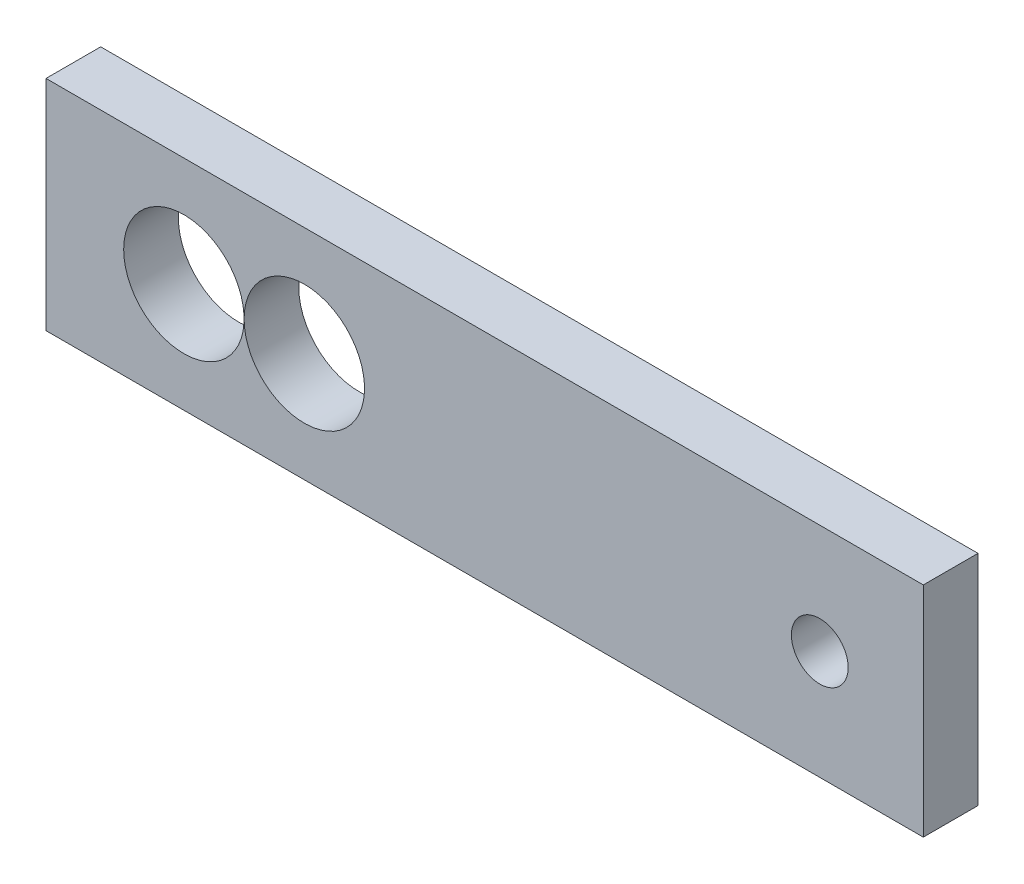
ISO-10303-21;
HEADER;
FILE_DESCRIPTION(('STEP AP214'),'2;1');
FILE_NAME('part.step','',(''),(''),'','','');
FILE_SCHEMA(('AUTOMOTIVE_DESIGN { 1 0 10303 214 1 1 1 1 }'));
ENDSEC;
DATA;
#1=APPLICATION_CONTEXT('core data for automotive mechanical design processes');
#2=APPLICATION_PROTOCOL_DEFINITION('international standard','automotive_design',2000,#1);
#3=PRODUCT_CONTEXT('',#1,'mechanical');
#4=PRODUCT('Part','Part','',(#3));
#5=PRODUCT_RELATED_PRODUCT_CATEGORY('part','',(#4));
#6=PRODUCT_DEFINITION_FORMATION('','',#4);
#7=PRODUCT_DEFINITION_CONTEXT('part definition',#1,'design');
#8=PRODUCT_DEFINITION('design','',#6,#7);
#9=PRODUCT_DEFINITION_SHAPE('','',#8);
#10=(LENGTH_UNIT() NAMED_UNIT(*) SI_UNIT(.MILLI.,.METRE.));
#11=(NAMED_UNIT(*) PLANE_ANGLE_UNIT() SI_UNIT($,.RADIAN.));
#12=(NAMED_UNIT(*) SI_UNIT($,.STERADIAN.) SOLID_ANGLE_UNIT());
#13=UNCERTAINTY_MEASURE_WITH_UNIT(LENGTH_MEASURE(1.E-05),#10,'distance_accuracy_value','');
#14=(GEOMETRIC_REPRESENTATION_CONTEXT(3) GLOBAL_UNCERTAINTY_ASSIGNED_CONTEXT((#13)) GLOBAL_UNIT_ASSIGNED_CONTEXT((#10,
#11,#12)) REPRESENTATION_CONTEXT('',''));
#15=CARTESIAN_POINT('',(0.,0.,0.));
#16=DIRECTION('',(0.,0.,1.));
#17=DIRECTION('',(1.,0.,0.));
#18=AXIS2_PLACEMENT_3D('',#15,#16,#17);
#19=CARTESIAN_POINT('',(-25.5,6.35,-3.18));
#20=DIRECTION('',(-1.,0.,0.));
#21=DIRECTION('',(0.,0.,1.));
#22=AXIS2_PLACEMENT_3D('',#19,#20,#21);
#23=PLANE('',#22);
#24=DIRECTION('',(0.,-1.,0.));
#25=VECTOR('',#24,1.);
#26=CARTESIAN_POINT('',(-25.5,6.35,0.));
#27=LINE('',#26,#25);
#28=CARTESIAN_POINT('',(-25.5,6.35,0.));
#29=VERTEX_POINT('',#28);
#30=CARTESIAN_POINT('',(-25.5,-6.35,0.));
#31=VERTEX_POINT('',#30);
#32=EDGE_CURVE('E108',#29,#31,#27,.T.);
#33=ORIENTED_EDGE('',*,*,#32,.F.);
#34=DIRECTION('',(0.,0.,1.));
#35=VECTOR('',#34,1.);
#36=CARTESIAN_POINT('',(-25.5,6.35,-3.18));
#37=LINE('',#36,#35);
#38=CARTESIAN_POINT('',(-25.5,6.35,-3.18));
#39=VERTEX_POINT('',#38);
#40=EDGE_CURVE('E11',#39,#29,#37,.T.);
#41=ORIENTED_EDGE('',*,*,#40,.F.);
#42=DIRECTION('',(0.,-1.,0.));
#43=VECTOR('',#42,1.);
#44=CARTESIAN_POINT('',(-25.5,6.35,-3.18));
#45=LINE('',#44,#43);
#46=CARTESIAN_POINT('',(-25.5,-6.35,-3.18));
#47=VERTEX_POINT('',#46);
#48=EDGE_CURVE('E101',#39,#47,#45,.T.);
#49=ORIENTED_EDGE('',*,*,#48,.T.);
#50=DIRECTION('',(0.,0.,1.));
#51=VECTOR('',#50,1.);
#52=CARTESIAN_POINT('',(-25.5,-6.35,-3.18));
#53=LINE('',#52,#51);
#54=EDGE_CURVE('E84',#47,#31,#53,.T.);
#55=ORIENTED_EDGE('',*,*,#54,.T.);
#56=EDGE_LOOP('',(#33,#41,#49,#55));
#57=FACE_BOUND('',#56,.T.);
#58=ADVANCED_FACE('F41',(#57),#23,.T.);
#59=CARTESIAN_POINT('',(25.5,6.35,-3.18));
#60=DIRECTION('',(0.,1.,0.));
#61=DIRECTION('',(-1.,0.,0.));
#62=AXIS2_PLACEMENT_3D('',#59,#60,#61);
#63=PLANE('',#62);
#64=DIRECTION('',(-1.,0.,0.));
#65=VECTOR('',#64,1.);
#66=CARTESIAN_POINT('',(25.5,6.35,0.));
#67=LINE('',#66,#65);
#68=CARTESIAN_POINT('',(25.5,6.35,0.));
#69=VERTEX_POINT('',#68);
#70=EDGE_CURVE('E103',#69,#29,#67,.T.);
#71=ORIENTED_EDGE('',*,*,#70,.F.);
#72=DIRECTION('',(0.,0.,1.));
#73=VECTOR('',#72,1.);
#74=CARTESIAN_POINT('',(25.5,6.35,-3.18));
#75=LINE('',#74,#73);
#76=CARTESIAN_POINT('',(25.5,6.35,-3.18));
#77=VERTEX_POINT('',#76);
#78=EDGE_CURVE('E50',#77,#69,#75,.T.);
#79=ORIENTED_EDGE('',*,*,#78,.F.);
#80=DIRECTION('',(-1.,0.,0.));
#81=VECTOR('',#80,1.);
#82=CARTESIAN_POINT('',(25.5,6.35,-3.18));
#83=LINE('',#82,#81);
#84=EDGE_CURVE('E98',#77,#39,#83,.T.);
#85=ORIENTED_EDGE('',*,*,#84,.T.);
#86=ORIENTED_EDGE('',*,*,#40,.T.);
#87=EDGE_LOOP('',(#71,#79,#85,#86));
#88=FACE_BOUND('',#87,.T.);
#89=ADVANCED_FACE('F143',(#88),#63,.T.);
#90=CARTESIAN_POINT('',(25.5,6.35,-3.18));
#91=DIRECTION('',(1.,0.,0.));
#92=DIRECTION('',(0.,0.,-1.));
#93=AXIS2_PLACEMENT_3D('',#90,#91,#92);
#94=PLANE('',#93);
#95=DIRECTION('',(0.,1.,0.));
#96=VECTOR('',#95,1.);
#97=CARTESIAN_POINT('',(25.5,6.35,0.));
#98=LINE('',#97,#96);
#99=CARTESIAN_POINT('',(25.5,-6.35,0.));
#100=VERTEX_POINT('',#99);
#101=EDGE_CURVE('E92',#100,#69,#98,.T.);
#102=ORIENTED_EDGE('',*,*,#101,.F.);
#103=DIRECTION('',(0.,0.,1.));
#104=VECTOR('',#103,1.);
#105=CARTESIAN_POINT('',(25.5,-6.35,-3.18));
#106=LINE('',#105,#104);
#107=CARTESIAN_POINT('',(25.5,-6.35,-3.18));
#108=VERTEX_POINT('',#107);
#109=EDGE_CURVE('E87',#108,#100,#106,.T.);
#110=ORIENTED_EDGE('',*,*,#109,.F.);
#111=DIRECTION('',(0.,1.,0.));
#112=VECTOR('',#111,1.);
#113=CARTESIAN_POINT('',(25.5,6.35,-3.18));
#114=LINE('',#113,#112);
#115=EDGE_CURVE('E90',#108,#77,#114,.T.);
#116=ORIENTED_EDGE('',*,*,#115,.T.);
#117=ORIENTED_EDGE('',*,*,#78,.T.);
#118=EDGE_LOOP('',(#102,#110,#116,#117));
#119=FACE_BOUND('',#118,.T.);
#120=ADVANCED_FACE('F89',(#119),#94,.T.);
#121=CARTESIAN_POINT('',(25.5,-6.35,-3.18));
#122=DIRECTION('',(0.,-1.,0.));
#123=DIRECTION('',(1.,0.,0.));
#124=AXIS2_PLACEMENT_3D('',#121,#122,#123);
#125=PLANE('',#124);
#126=DIRECTION('',(1.,0.,0.));
#127=VECTOR('',#126,1.);
#128=CARTESIAN_POINT('',(25.5,-6.35,0.));
#129=LINE('',#128,#127);
#130=EDGE_CURVE('E111',#31,#100,#129,.T.);
#131=ORIENTED_EDGE('',*,*,#130,.F.);
#132=ORIENTED_EDGE('',*,*,#54,.F.);
#133=DIRECTION('',(1.,0.,0.));
#134=VECTOR('',#133,1.);
#135=CARTESIAN_POINT('',(25.5,-6.35,-3.18));
#136=LINE('',#135,#134);
#137=EDGE_CURVE('E97',#47,#108,#136,.T.);
#138=ORIENTED_EDGE('',*,*,#137,.T.);
#139=ORIENTED_EDGE('',*,*,#109,.T.);
#140=EDGE_LOOP('',(#131,#132,#138,#139));
#141=FACE_BOUND('',#140,.T.);
#142=ADVANCED_FACE('F100',(#141),#125,.T.);
#143=CARTESIAN_POINT('',(0.,0.,-3.18));
#144=DIRECTION('',(0.,0.,-1.));
#145=DIRECTION('',(-1.,0.,0.));
#146=AXIS2_PLACEMENT_3D('',#143,#144,#145);
#147=PLANE('',#146);
#148=CARTESIAN_POINT('',(-17.4849999999995,1.06926114114465E-13,-3.18));
#149=DIRECTION('',(0.,0.,-1.));
#150=DIRECTION('',(-1.,0.,0.));
#151=AXIS2_PLACEMENT_3D('',#148,#149,#150);
#152=CIRCLE('',#151,3.5);
#153=CARTESIAN_POINT('',(-20.9849999999995,1.06926114114465E-13,-3.18));
#154=VERTEX_POINT('',#153);
#155=EDGE_CURVE('E121',#154,#154,#152,.T.);
#156=ORIENTED_EDGE('',*,*,#155,.F.);
#157=EDGE_LOOP('',(#156));
#158=FACE_BOUND('',#157,.T.);
#159=CARTESIAN_POINT('',(19.4824999999999,0.,-3.18));
#160=DIRECTION('',(0.,0.,-1.));
#161=DIRECTION('',(-1.,0.,0.));
#162=AXIS2_PLACEMENT_3D('',#159,#160,#161);
#163=CIRCLE('',#162,1.65);
#164=CARTESIAN_POINT('',(17.8324999999999,0.,-3.18));
#165=VERTEX_POINT('',#164);
#166=EDGE_CURVE('E233',#165,#165,#163,.T.);
#167=ORIENTED_EDGE('',*,*,#166,.F.);
#168=EDGE_LOOP('',(#167));
#169=FACE_BOUND('',#168,.T.);
#170=CARTESIAN_POINT('',(-10.4839999999995,0.,-3.18));
#171=DIRECTION('',(0.,0.,-1.));
#172=DIRECTION('',(-1.,0.,0.));
#173=AXIS2_PLACEMENT_3D('',#170,#171,#172);
#174=CIRCLE('',#173,3.5);
#175=CARTESIAN_POINT('',(-13.9839999999995,0.,-3.18));
#176=VERTEX_POINT('',#175);
#177=EDGE_CURVE('E236',#176,#176,#174,.T.);
#178=ORIENTED_EDGE('',*,*,#177,.F.);
#179=EDGE_LOOP('',(#178));
#180=FACE_BOUND('',#179,.T.);
#181=ORIENTED_EDGE('',*,*,#48,.F.);
#182=ORIENTED_EDGE('',*,*,#84,.F.);
#183=ORIENTED_EDGE('',*,*,#115,.F.);
#184=ORIENTED_EDGE('',*,*,#137,.F.);
#185=EDGE_LOOP('',(#181,#182,#183,#184));
#186=FACE_BOUND('',#185,.T.);
#187=ADVANCED_FACE('F96',(#158,#169,#180,#186),#147,.T.);
#188=CARTESIAN_POINT('',(0.,0.,0.));
#189=DIRECTION('',(0.,0.,-1.));
#190=DIRECTION('',(-1.,0.,0.));
#191=AXIS2_PLACEMENT_3D('',#188,#189,#190);
#192=PLANE('',#191);
#193=CARTESIAN_POINT('',(-17.4849999999995,1.06926114114465E-13,0.));
#194=DIRECTION('',(0.,0.,-1.));
#195=DIRECTION('',(-1.,0.,0.));
#196=AXIS2_PLACEMENT_3D('',#193,#194,#195);
#197=CIRCLE('',#196,3.5);
#198=CARTESIAN_POINT('',(-20.9849999999995,1.06926114114465E-13,0.));
#199=VERTEX_POINT('',#198);
#200=EDGE_CURVE('E44',#199,#199,#197,.T.);
#201=ORIENTED_EDGE('',*,*,#200,.T.);
#202=EDGE_LOOP('',(#201));
#203=FACE_BOUND('',#202,.T.);
#204=CARTESIAN_POINT('',(19.4824999999999,0.,0.));
#205=DIRECTION('',(0.,0.,-1.));
#206=DIRECTION('',(-1.,0.,0.));
#207=AXIS2_PLACEMENT_3D('',#204,#205,#206);
#208=CIRCLE('',#207,1.65);
#209=CARTESIAN_POINT('',(17.8324999999999,0.,0.));
#210=VERTEX_POINT('',#209);
#211=EDGE_CURVE('E120',#210,#210,#208,.T.);
#212=ORIENTED_EDGE('',*,*,#211,.T.);
#213=EDGE_LOOP('',(#212));
#214=FACE_BOUND('',#213,.T.);
#215=CARTESIAN_POINT('',(-10.4839999999995,0.,0.));
#216=DIRECTION('',(0.,0.,-1.));
#217=DIRECTION('',(-1.,0.,0.));
#218=AXIS2_PLACEMENT_3D('',#215,#216,#217);
#219=CIRCLE('',#218,3.5);
#220=CARTESIAN_POINT('',(-13.9839999999995,0.,0.));
#221=VERTEX_POINT('',#220);
#222=EDGE_CURVE('E118',#221,#221,#219,.T.);
#223=ORIENTED_EDGE('',*,*,#222,.T.);
#224=EDGE_LOOP('',(#223));
#225=FACE_BOUND('',#224,.T.);
#226=ORIENTED_EDGE('',*,*,#32,.T.);
#227=ORIENTED_EDGE('',*,*,#130,.T.);
#228=ORIENTED_EDGE('',*,*,#101,.T.);
#229=ORIENTED_EDGE('',*,*,#70,.T.);
#230=EDGE_LOOP('',(#226,#227,#228,#229));
#231=FACE_BOUND('',#230,.T.);
#232=ADVANCED_FACE('F128',(#203,#214,#225,#231),#192,.F.);
#233=CARTESIAN_POINT('',(-10.4839999999995,0.,6.82));
#234=DIRECTION('',(0.,0.,-1.));
#235=DIRECTION('',(-1.,0.,0.));
#236=AXIS2_PLACEMENT_3D('',#233,#234,#235);
#237=CYLINDRICAL_SURFACE('',#236,3.5);
#238=ORIENTED_EDGE('',*,*,#177,.T.);
#239=EDGE_LOOP('',(#238));
#240=FACE_BOUND('',#239,.T.);
#241=ORIENTED_EDGE('',*,*,#222,.F.);
#242=EDGE_LOOP('',(#241));
#243=FACE_BOUND('',#242,.T.);
#244=ADVANCED_FACE('F138',(#240,#243),#237,.F.);
#245=CARTESIAN_POINT('',(19.4824999999999,0.,6.82));
#246=DIRECTION('',(0.,0.,-1.));
#247=DIRECTION('',(-1.,0.,0.));
#248=AXIS2_PLACEMENT_3D('',#245,#246,#247);
#249=CYLINDRICAL_SURFACE('',#248,1.65);
#250=ORIENTED_EDGE('',*,*,#166,.T.);
#251=EDGE_LOOP('',(#250));
#252=FACE_BOUND('',#251,.T.);
#253=ORIENTED_EDGE('',*,*,#211,.F.);
#254=EDGE_LOOP('',(#253));
#255=FACE_BOUND('',#254,.T.);
#256=ADVANCED_FACE('F132',(#252,#255),#249,.F.);
#257=CARTESIAN_POINT('',(-17.4849999999995,1.06926114114465E-13,6.82));
#258=DIRECTION('',(0.,0.,-1.));
#259=DIRECTION('',(-1.,0.,0.));
#260=AXIS2_PLACEMENT_3D('',#257,#258,#259);
#261=CYLINDRICAL_SURFACE('',#260,3.5);
#262=ORIENTED_EDGE('',*,*,#155,.T.);
#263=EDGE_LOOP('',(#262));
#264=FACE_BOUND('',#263,.T.);
#265=ORIENTED_EDGE('',*,*,#200,.F.);
#266=EDGE_LOOP('',(#265));
#267=FACE_BOUND('',#266,.T.);
#268=ADVANCED_FACE('F130',(#264,#267),#261,.F.);
#269=CLOSED_SHELL('',(#58,#89,#120,#142,#187,#232,#244,#256,#268));
#270=MANIFOLD_SOLID_BREP('B2',#269);
#271=ADVANCED_BREP_SHAPE_REPRESENTATION('',(#18,#270),#14);
#272=SHAPE_DEFINITION_REPRESENTATION(#9,#271);
ENDSEC;
END-ISO-10303-21;
